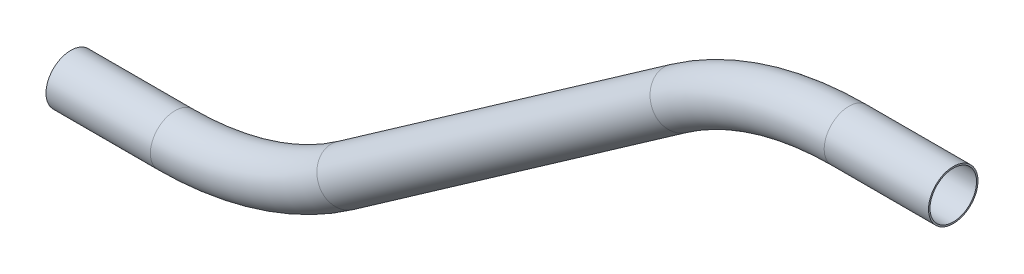
ISO-10303-21;
HEADER;
FILE_DESCRIPTION(('STEP AP214'),'2;1');
FILE_NAME('part.step','',(''),(''),'','','');
FILE_SCHEMA(('AUTOMOTIVE_DESIGN { 1 0 10303 214 1 1 1 1 }'));
ENDSEC;
DATA;
#1=APPLICATION_CONTEXT('core data for automotive mechanical design processes');
#2=APPLICATION_PROTOCOL_DEFINITION('international standard','automotive_design',2000,#1);
#3=PRODUCT_CONTEXT('',#1,'mechanical');
#4=PRODUCT('Part','Part','',(#3));
#5=PRODUCT_RELATED_PRODUCT_CATEGORY('part','',(#4));
#6=PRODUCT_DEFINITION_FORMATION('','',#4);
#7=PRODUCT_DEFINITION_CONTEXT('part definition',#1,'design');
#8=PRODUCT_DEFINITION('design','',#6,#7);
#9=PRODUCT_DEFINITION_SHAPE('','',#8);
#10=(LENGTH_UNIT() NAMED_UNIT(*) SI_UNIT(.MILLI.,.METRE.));
#11=(NAMED_UNIT(*) PLANE_ANGLE_UNIT() SI_UNIT($,.RADIAN.));
#12=(NAMED_UNIT(*) SI_UNIT($,.STERADIAN.) SOLID_ANGLE_UNIT());
#13=UNCERTAINTY_MEASURE_WITH_UNIT(LENGTH_MEASURE(1.E-05),#10,'distance_accuracy_value','');
#14=(GEOMETRIC_REPRESENTATION_CONTEXT(3) GLOBAL_UNCERTAINTY_ASSIGNED_CONTEXT((#13)) GLOBAL_UNIT_ASSIGNED_CONTEXT((#10,
#11,#12)) REPRESENTATION_CONTEXT('',''));
#15=CARTESIAN_POINT('',(0.,0.,0.));
#16=DIRECTION('',(0.,0.,1.));
#17=DIRECTION('',(1.,0.,0.));
#18=AXIS2_PLACEMENT_3D('',#15,#16,#17);
#19=CARTESIAN_POINT('',(121.865926636058,47.4325265861424,0.));
#20=DIRECTION('',(-1.,0.,0.));
#21=DIRECTION('',(0.,-1.,0.));
#22=AXIS2_PLACEMENT_3D('',#19,#20,#21);
#23=CYLINDRICAL_SURFACE('',#22,6.35);
#24=CARTESIAN_POINT('',(95.0916943486364,47.4325265861424,0.));
#25=DIRECTION('',(-1.,0.,0.));
#26=DIRECTION('',(0.,-1.,0.));
#27=AXIS2_PLACEMENT_3D('',#24,#25,#26);
#28=CIRCLE('',#27,6.35);
#29=CARTESIAN_POINT('',(95.0916943486364,53.7825265861424,0.));
#30=VERTEX_POINT('',#29);
#31=EDGE_CURVE('E57',#30,#30,#28,.T.);
#32=ORIENTED_EDGE('',*,*,#31,.F.);
#33=EDGE_LOOP('',(#32));
#34=FACE_BOUND('',#33,.T.);
#35=CARTESIAN_POINT('',(121.865926636058,47.4325265861424,0.));
#36=DIRECTION('',(-1.,0.,0.));
#37=DIRECTION('',(0.,-1.,0.));
#38=AXIS2_PLACEMENT_3D('',#35,#36,#37);
#39=CIRCLE('',#38,6.35);
#40=CARTESIAN_POINT('',(121.865926636058,41.0825265861424,0.));
#41=VERTEX_POINT('',#40);
#42=EDGE_CURVE('E54',#41,#41,#39,.T.);
#43=ORIENTED_EDGE('',*,*,#42,.T.);
#44=EDGE_LOOP('',(#43));
#45=FACE_BOUND('',#44,.T.);
#46=ADVANCED_FACE('F33',(#34,#45),#23,.T.);
#47=CARTESIAN_POINT('',(95.0916943486364,-28.7674734138575,0.));
#48=DIRECTION('',(0.,0.,1.));
#49=DIRECTION('',(1.,0.,0.));
#50=AXIS2_PLACEMENT_3D('',#47,#48,#49);
#51=TOROIDAL_SURFACE('',#50,76.2,6.35);
#52=CARTESIAN_POINT('',(51.3851698986866,33.6519123609635,0.));
#53=DIRECTION('',(-0.819152044288991,-0.573576436351047,0.));
#54=DIRECTION('',(0.573576436351047,-0.819152044288991,0.));
#55=AXIS2_PLACEMENT_3D('',#52,#53,#54);
#56=CIRCLE('',#55,6.35);
#57=CARTESIAN_POINT('',(47.7429595278574,38.8535278421986,0.));
#58=VERTEX_POINT('',#57);
#59=EDGE_CURVE('E60',#58,#58,#56,.T.);
#60=CARTESIAN_POINT('',(95.0916943486364,-28.7674734138575,0.));
#61=DIRECTION('',(0.,0.,1.));
#62=DIRECTION('',(1.,0.,0.));
#63=AXIS2_PLACEMENT_3D('',#60,#61,#62);
#64=CIRCLE('',#63,82.55);
#65=EDGE_CURVE('',#30,#58,#64,.T.);
#66=ORIENTED_EDGE('',*,*,#31,.T.);
#67=ORIENTED_EDGE('',*,*,#59,.F.);
#68=ORIENTED_EDGE('',*,*,#65,.T.);
#69=ORIENTED_EDGE('',*,*,#65,.F.);
#70=EDGE_LOOP('',(#66,#68,#67,#69));
#71=FACE_BOUND('',#70,.T.);
#72=ADVANCED_FACE('F79',(#71),#51,.T.);
#73=CARTESIAN_POINT('',(51.3851698986866,33.6519123609635,0.));
#74=DIRECTION('',(-0.819152044288991,-0.573576436351048,0.));
#75=DIRECTION('',(0.573576436351048,-0.819152044288991,0.));
#76=AXIS2_PLACEMENT_3D('',#73,#74,#75);
#77=CYLINDRICAL_SURFACE('',#76,6.35);
#78=CARTESIAN_POINT('',(-34.0920881762132,-26.1999080885784,0.));
#79=DIRECTION('',(-0.819152044288991,-0.573576436351047,0.));
#80=DIRECTION('',(0.573576436351047,-0.819152044288991,0.));
#81=AXIS2_PLACEMENT_3D('',#78,#79,#80);
#82=CIRCLE('',#81,6.35);
#83=CARTESIAN_POINT('',(-30.4498778053841,-31.4015235698134,0.));
#84=VERTEX_POINT('',#83);
#85=EDGE_CURVE('E62',#84,#84,#82,.T.);
#86=ORIENTED_EDGE('',*,*,#85,.F.);
#87=EDGE_LOOP('',(#86));
#88=FACE_BOUND('',#87,.T.);
#89=ORIENTED_EDGE('',*,*,#59,.T.);
#90=EDGE_LOOP('',(#89));
#91=FACE_BOUND('',#90,.T.);
#92=ADVANCED_FACE('F72',(#88,#91),#77,.T.);
#93=CARTESIAN_POINT('',(-77.7986126261631,36.2194776862428,0.));
#94=DIRECTION('',(0.,0.,-1.));
#95=DIRECTION('',(-1.,0.,0.));
#96=AXIS2_PLACEMENT_3D('',#93,#94,#95);
#97=TOROIDAL_SURFACE('',#96,76.2,6.35);
#98=CARTESIAN_POINT('',(-77.7986126261629,-39.9805223137574,0.));
#99=DIRECTION('',(-1.,0.,0.));
#100=DIRECTION('',(0.,-1.,0.));
#101=AXIS2_PLACEMENT_3D('',#98,#99,#100);
#102=CIRCLE('',#101,6.35);
#103=CARTESIAN_POINT('',(-77.7986126261629,-46.3305223137572,0.));
#104=VERTEX_POINT('',#103);
#105=EDGE_CURVE('E37',#104,#104,#102,.T.);
#106=CARTESIAN_POINT('',(-77.7986126261631,36.2194776862428,0.));
#107=DIRECTION('',(0.,0.,-1.));
#108=DIRECTION('',(-1.,0.,0.));
#109=AXIS2_PLACEMENT_3D('',#106,#107,#108);
#110=CIRCLE('',#109,82.55);
#111=EDGE_CURVE('',#84,#104,#110,.T.);
#112=ORIENTED_EDGE('',*,*,#85,.T.);
#113=ORIENTED_EDGE('',*,*,#105,.F.);
#114=ORIENTED_EDGE('',*,*,#111,.T.);
#115=ORIENTED_EDGE('',*,*,#111,.F.);
#116=EDGE_LOOP('',(#112,#114,#113,#115));
#117=FACE_BOUND('',#116,.T.);
#118=ADVANCED_FACE('F70',(#117),#97,.T.);
#119=CARTESIAN_POINT('',(-77.7986126261629,-39.9805223137574,0.));
#120=DIRECTION('',(-1.,0.,0.));
#121=DIRECTION('',(0.,-1.,0.));
#122=AXIS2_PLACEMENT_3D('',#119,#120,#121);
#123=CYLINDRICAL_SURFACE('',#122,6.35);
#124=CARTESIAN_POINT('',(-104.572844913584,-39.9805223137574,0.));
#125=DIRECTION('',(-1.,0.,0.));
#126=DIRECTION('',(0.,-1.,0.));
#127=AXIS2_PLACEMENT_3D('',#124,#125,#126);
#128=CIRCLE('',#127,6.35);
#129=CARTESIAN_POINT('',(-104.572844913584,-46.3305223137574,0.));
#130=VERTEX_POINT('',#129);
#131=EDGE_CURVE('E50',#130,#130,#128,.T.);
#132=ORIENTED_EDGE('',*,*,#131,.F.);
#133=EDGE_LOOP('',(#132));
#134=FACE_BOUND('',#133,.T.);
#135=ORIENTED_EDGE('',*,*,#105,.T.);
#136=EDGE_LOOP('',(#135));
#137=FACE_BOUND('',#136,.T.);
#138=ADVANCED_FACE('F35',(#134,#137),#123,.T.);
#139=CARTESIAN_POINT('',(121.865926636058,47.4325265861424,0.));
#140=DIRECTION('',(-1.,0.,0.));
#141=DIRECTION('',(0.,-1.,0.));
#142=AXIS2_PLACEMENT_3D('',#139,#140,#141);
#143=PLANE('',#142);
#144=CARTESIAN_POINT('',(121.865926636058,47.4325265861424,0.));
#145=DIRECTION('',(-1.,0.,0.));
#146=DIRECTION('',(0.,-1.,0.));
#147=AXIS2_PLACEMENT_3D('',#144,#145,#146);
#148=CIRCLE('',#147,5.969);
#149=CARTESIAN_POINT('',(121.865926636058,41.4635265861424,0.));
#150=VERTEX_POINT('',#149);
#151=EDGE_CURVE('E53',#150,#150,#148,.F.);
#152=ORIENTED_EDGE('',*,*,#151,.F.);
#153=EDGE_LOOP('',(#152));
#154=FACE_BOUND('',#153,.T.);
#155=ORIENTED_EDGE('',*,*,#42,.F.);
#156=EDGE_LOOP('',(#155));
#157=FACE_BOUND('',#156,.T.);
#158=ADVANCED_FACE('F77',(#154,#157),#143,.F.);
#159=CARTESIAN_POINT('',(-104.572844913584,-39.9805223137574,0.));
#160=DIRECTION('',(-1.,0.,0.));
#161=DIRECTION('',(0.,-1.,0.));
#162=AXIS2_PLACEMENT_3D('',#159,#160,#161);
#163=PLANE('',#162);
#164=CARTESIAN_POINT('',(-104.572844913584,-39.9805223137574,0.));
#165=DIRECTION('',(-1.,0.,0.));
#166=DIRECTION('',(0.,-1.,0.));
#167=AXIS2_PLACEMENT_3D('',#164,#165,#166);
#168=CIRCLE('',#167,5.969);
#169=CARTESIAN_POINT('',(-104.572844913584,-45.9495223137574,0.));
#170=VERTEX_POINT('',#169);
#171=EDGE_CURVE('E10',#170,#170,#168,.F.);
#172=ORIENTED_EDGE('',*,*,#171,.T.);
#173=EDGE_LOOP('',(#172));
#174=FACE_BOUND('',#173,.T.);
#175=ORIENTED_EDGE('',*,*,#131,.T.);
#176=EDGE_LOOP('',(#175));
#177=FACE_BOUND('',#176,.T.);
#178=ADVANCED_FACE('F96',(#174,#177),#163,.T.);
#179=CARTESIAN_POINT('',(121.865926636058,47.4325265861424,0.));
#180=DIRECTION('',(-1.,0.,0.));
#181=DIRECTION('',(0.,-1.,0.));
#182=AXIS2_PLACEMENT_3D('',#179,#180,#181);
#183=CYLINDRICAL_SURFACE('',#182,5.969);
#184=CARTESIAN_POINT('',(95.0916943486364,47.4325265861424,0.));
#185=DIRECTION('',(-1.,0.,0.));
#186=DIRECTION('',(0.,-1.,0.));
#187=AXIS2_PLACEMENT_3D('',#184,#185,#186);
#188=CIRCLE('',#187,5.969);
#189=CARTESIAN_POINT('',(95.0916943486364,53.4015265861425,0.));
#190=VERTEX_POINT('',#189);
#191=EDGE_CURVE('E192',#190,#190,#188,.F.);
#192=ORIENTED_EDGE('',*,*,#191,.F.);
#193=EDGE_LOOP('',(#192));
#194=FACE_BOUND('',#193,.T.);
#195=ORIENTED_EDGE('',*,*,#151,.T.);
#196=EDGE_LOOP('',(#195));
#197=FACE_BOUND('',#196,.T.);
#198=ADVANCED_FACE('F99',(#194,#197),#183,.F.);
#199=CARTESIAN_POINT('',(95.0916943486364,-28.7674734138575,0.));
#200=DIRECTION('',(0.,0.,1.));
#201=DIRECTION('',(1.,0.,0.));
#202=AXIS2_PLACEMENT_3D('',#199,#200,#201);
#203=TOROIDAL_SURFACE('',#202,76.2,5.969);
#204=CARTESIAN_POINT('',(51.3851698986866,33.6519123609635,0.));
#205=DIRECTION('',(-0.819152044288991,-0.573576436351047,0.));
#206=DIRECTION('',(0.573576436351047,-0.819152044288991,0.));
#207=AXIS2_PLACEMENT_3D('',#204,#205,#206);
#208=CIRCLE('',#207,5.969);
#209=CARTESIAN_POINT('',(47.9614921501072,38.5414309133245,0.));
#210=VERTEX_POINT('',#209);
#211=EDGE_CURVE('E191',#210,#210,#208,.F.);
#212=CARTESIAN_POINT('',(95.0916943486364,-28.7674734138575,0.));
#213=DIRECTION('',(0.,0.,1.));
#214=DIRECTION('',(1.,0.,0.));
#215=AXIS2_PLACEMENT_3D('',#212,#213,#214);
#216=CIRCLE('',#215,82.169);
#217=EDGE_CURVE('',#190,#210,#216,.T.);
#218=ORIENTED_EDGE('',*,*,#191,.T.);
#219=ORIENTED_EDGE('',*,*,#211,.F.);
#220=ORIENTED_EDGE('',*,*,#217,.T.);
#221=ORIENTED_EDGE('',*,*,#217,.F.);
#222=EDGE_LOOP('',(#218,#220,#219,#221));
#223=FACE_BOUND('',#222,.T.);
#224=ADVANCED_FACE('F154',(#223),#203,.F.);
#225=CARTESIAN_POINT('',(51.3851698986866,33.6519123609635,0.));
#226=DIRECTION('',(-0.819152044288991,-0.573576436351048,0.));
#227=DIRECTION('',(0.573576436351048,-0.819152044288991,0.));
#228=AXIS2_PLACEMENT_3D('',#225,#226,#227);
#229=CYLINDRICAL_SURFACE('',#228,5.969);
#230=CARTESIAN_POINT('',(-34.0920881762132,-26.1999080885784,0.));
#231=DIRECTION('',(-0.819152044288991,-0.573576436351047,0.));
#232=DIRECTION('',(0.573576436351047,-0.819152044288991,0.));
#233=AXIS2_PLACEMENT_3D('',#230,#231,#232);
#234=CIRCLE('',#233,5.969);
#235=CARTESIAN_POINT('',(-30.6684104276339,-31.0894266409393,0.));
#236=VERTEX_POINT('',#235);
#237=EDGE_CURVE('E46',#236,#236,#234,.F.);
#238=ORIENTED_EDGE('',*,*,#237,.F.);
#239=EDGE_LOOP('',(#238));
#240=FACE_BOUND('',#239,.T.);
#241=ORIENTED_EDGE('',*,*,#211,.T.);
#242=EDGE_LOOP('',(#241));
#243=FACE_BOUND('',#242,.T.);
#244=ADVANCED_FACE('F90',(#240,#243),#229,.F.);
#245=CARTESIAN_POINT('',(-77.7986126261631,36.2194776862428,0.));
#246=DIRECTION('',(0.,0.,-1.));
#247=DIRECTION('',(-1.,0.,0.));
#248=AXIS2_PLACEMENT_3D('',#245,#246,#247);
#249=TOROIDAL_SURFACE('',#248,76.2,5.969);
#250=CARTESIAN_POINT('',(-77.7986126261629,-39.9805223137574,0.));
#251=DIRECTION('',(-1.,0.,0.));
#252=DIRECTION('',(0.,-1.,0.));
#253=AXIS2_PLACEMENT_3D('',#250,#251,#252);
#254=CIRCLE('',#253,5.969);
#255=CARTESIAN_POINT('',(-77.7986126261629,-45.9495223137572,0.));
#256=VERTEX_POINT('',#255);
#257=EDGE_CURVE('E41',#256,#256,#254,.F.);
#258=CARTESIAN_POINT('',(-77.7986126261631,36.2194776862428,0.));
#259=DIRECTION('',(0.,0.,-1.));
#260=DIRECTION('',(-1.,0.,0.));
#261=AXIS2_PLACEMENT_3D('',#258,#259,#260);
#262=CIRCLE('',#261,82.169);
#263=EDGE_CURVE('',#236,#256,#262,.T.);
#264=ORIENTED_EDGE('',*,*,#237,.T.);
#265=ORIENTED_EDGE('',*,*,#257,.F.);
#266=ORIENTED_EDGE('',*,*,#263,.T.);
#267=ORIENTED_EDGE('',*,*,#263,.F.);
#268=EDGE_LOOP('',(#264,#266,#265,#267));
#269=FACE_BOUND('',#268,.T.);
#270=ADVANCED_FACE('F84',(#269),#249,.F.);
#271=CARTESIAN_POINT('',(-77.7986126261629,-39.9805223137574,0.));
#272=DIRECTION('',(-1.,0.,0.));
#273=DIRECTION('',(0.,-1.,0.));
#274=AXIS2_PLACEMENT_3D('',#271,#272,#273);
#275=CYLINDRICAL_SURFACE('',#274,5.969);
#276=ORIENTED_EDGE('',*,*,#171,.F.);
#277=EDGE_LOOP('',(#276));
#278=FACE_BOUND('',#277,.T.);
#279=ORIENTED_EDGE('',*,*,#257,.T.);
#280=EDGE_LOOP('',(#279));
#281=FACE_BOUND('',#280,.T.);
#282=ADVANCED_FACE('F82',(#278,#281),#275,.F.);
#283=CLOSED_SHELL('',(#46,#72,#92,#118,#138,#158,#178,#198,#224,#244,#270,#282));
#284=MANIFOLD_SOLID_BREP('B2',#283);
#285=ADVANCED_BREP_SHAPE_REPRESENTATION('',(#18,#284),#14);
#286=SHAPE_DEFINITION_REPRESENTATION(#9,#285);
ENDSEC;
END-ISO-10303-21;
